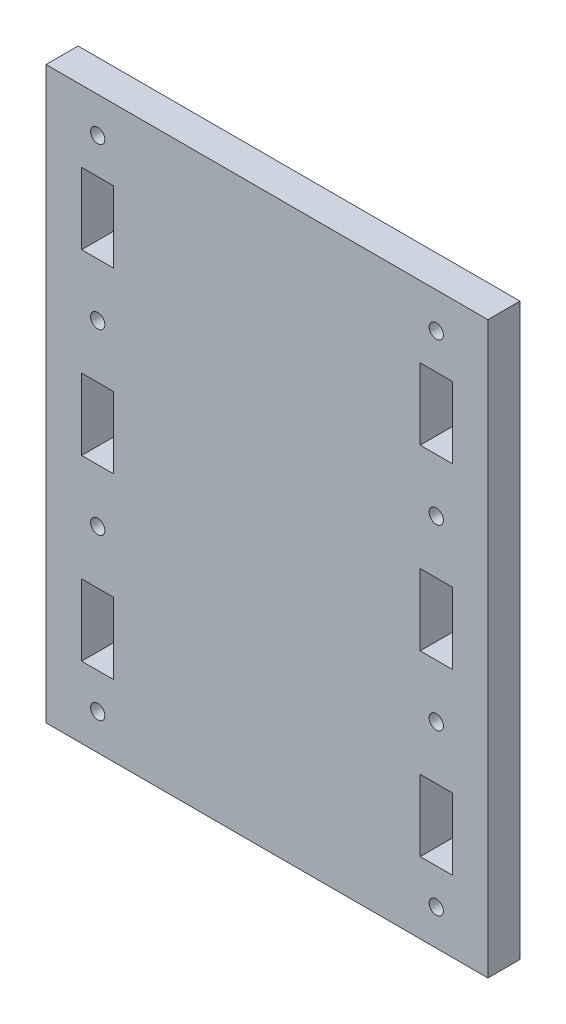
ISO-10303-21;
HEADER;
FILE_DESCRIPTION(('STEP AP214'),'2;1');
FILE_NAME('part.step','',(''),(''),'','','');
FILE_SCHEMA(('AUTOMOTIVE_DESIGN { 1 0 10303 214 1 1 1 1 }'));
ENDSEC;
DATA;
#1=APPLICATION_CONTEXT('core data for automotive mechanical design processes');
#2=APPLICATION_PROTOCOL_DEFINITION('international standard','automotive_design',2000,#1);
#3=PRODUCT_CONTEXT('',#1,'mechanical');
#4=PRODUCT('Part','Part','',(#3));
#5=PRODUCT_RELATED_PRODUCT_CATEGORY('part','',(#4));
#6=PRODUCT_DEFINITION_FORMATION('','',#4);
#7=PRODUCT_DEFINITION_CONTEXT('part definition',#1,'design');
#8=PRODUCT_DEFINITION('design','',#6,#7);
#9=PRODUCT_DEFINITION_SHAPE('','',#8);
#10=(LENGTH_UNIT() NAMED_UNIT(*) SI_UNIT(.MILLI.,.METRE.));
#11=(NAMED_UNIT(*) PLANE_ANGLE_UNIT() SI_UNIT($,.RADIAN.));
#12=(NAMED_UNIT(*) SI_UNIT($,.STERADIAN.) SOLID_ANGLE_UNIT());
#13=UNCERTAINTY_MEASURE_WITH_UNIT(LENGTH_MEASURE(1.E-05),#10,'distance_accuracy_value','');
#14=(GEOMETRIC_REPRESENTATION_CONTEXT(3) GLOBAL_UNCERTAINTY_ASSIGNED_CONTEXT((#13)) GLOBAL_UNIT_ASSIGNED_CONTEXT((#10,
#11,#12)) REPRESENTATION_CONTEXT('',''));
#15=CARTESIAN_POINT('',(0.,0.,0.));
#16=DIRECTION('',(0.,0.,1.));
#17=DIRECTION('',(1.,0.,0.));
#18=AXIS2_PLACEMENT_3D('',#15,#16,#17);
#19=CARTESIAN_POINT('',(0.,0.,29.));
#20=DIRECTION('',(0.,0.,1.));
#21=DIRECTION('',(1.,0.,0.));
#22=AXIS2_PLACEMENT_3D('',#19,#20,#21);
#23=PLANE('',#22);
#24=CARTESIAN_POINT('',(47.5,200.,29.));
#25=DIRECTION('',(0.,0.,-1.));
#26=DIRECTION('',(-1.,0.,0.));
#27=AXIS2_PLACEMENT_3D('',#24,#25,#26);
#28=CIRCLE('',#27,2.);
#29=CARTESIAN_POINT('',(45.5,200.,29.));
#30=VERTEX_POINT('',#29);
#31=EDGE_CURVE('E885',#30,#30,#28,.T.);
#32=ORIENTED_EDGE('',*,*,#31,.T.);
#33=EDGE_LOOP('',(#32));
#34=FACE_BOUND('',#33,.T.);
#35=CARTESIAN_POINT('',(-47.5,60.,29.));
#36=DIRECTION('',(0.,0.,-1.));
#37=DIRECTION('',(-1.,0.,0.));
#38=AXIS2_PLACEMENT_3D('',#35,#36,#37);
#39=CIRCLE('',#38,2.);
#40=CARTESIAN_POINT('',(-49.5,60.,29.));
#41=VERTEX_POINT('',#40);
#42=EDGE_CURVE('E893',#41,#41,#39,.T.);
#43=ORIENTED_EDGE('',*,*,#42,.T.);
#44=EDGE_LOOP('',(#43));
#45=FACE_BOUND('',#44,.T.);
#46=CARTESIAN_POINT('',(-47.5,105.,29.));
#47=DIRECTION('',(0.,0.,-1.));
#48=DIRECTION('',(-1.,0.,0.));
#49=AXIS2_PLACEMENT_3D('',#46,#47,#48);
#50=CIRCLE('',#49,2.);
#51=CARTESIAN_POINT('',(-49.5,105.,29.));
#52=VERTEX_POINT('',#51);
#53=EDGE_CURVE('E899',#52,#52,#50,.T.);
#54=ORIENTED_EDGE('',*,*,#53,.T.);
#55=EDGE_LOOP('',(#54));
#56=FACE_BOUND('',#55,.T.);
#57=CARTESIAN_POINT('',(-47.5,155.,29.));
#58=DIRECTION('',(0.,0.,-1.));
#59=DIRECTION('',(-1.,0.,0.));
#60=AXIS2_PLACEMENT_3D('',#57,#58,#59);
#61=CIRCLE('',#60,2.);
#62=CARTESIAN_POINT('',(-49.5,155.,29.));
#63=VERTEX_POINT('',#62);
#64=EDGE_CURVE('E905',#63,#63,#61,.T.);
#65=ORIENTED_EDGE('',*,*,#64,.T.);
#66=EDGE_LOOP('',(#65));
#67=FACE_BOUND('',#66,.T.);
#68=CARTESIAN_POINT('',(-47.5,200.,29.));
#69=DIRECTION('',(0.,0.,-1.));
#70=DIRECTION('',(-1.,0.,0.));
#71=AXIS2_PLACEMENT_3D('',#68,#69,#70);
#72=CIRCLE('',#71,2.);
#73=CARTESIAN_POINT('',(-49.5,200.,29.));
#74=VERTEX_POINT('',#73);
#75=EDGE_CURVE('E911',#74,#74,#72,.T.);
#76=ORIENTED_EDGE('',*,*,#75,.T.);
#77=EDGE_LOOP('',(#76));
#78=FACE_BOUND('',#77,.T.);
#79=CARTESIAN_POINT('',(47.5,60.,29.));
#80=DIRECTION('',(0.,0.,-1.));
#81=DIRECTION('',(-1.,0.,0.));
#82=AXIS2_PLACEMENT_3D('',#79,#80,#81);
#83=CIRCLE('',#82,2.);
#84=CARTESIAN_POINT('',(45.5,60.,29.));
#85=VERTEX_POINT('',#84);
#86=EDGE_CURVE('E917',#85,#85,#83,.T.);
#87=ORIENTED_EDGE('',*,*,#86,.T.);
#88=EDGE_LOOP('',(#87));
#89=FACE_BOUND('',#88,.T.);
#90=CARTESIAN_POINT('',(47.5,105.,29.));
#91=DIRECTION('',(0.,0.,-1.));
#92=DIRECTION('',(-1.,0.,0.));
#93=AXIS2_PLACEMENT_3D('',#90,#91,#92);
#94=CIRCLE('',#93,2.);
#95=CARTESIAN_POINT('',(45.5,105.,29.));
#96=VERTEX_POINT('',#95);
#97=EDGE_CURVE('E923',#96,#96,#94,.T.);
#98=ORIENTED_EDGE('',*,*,#97,.T.);
#99=EDGE_LOOP('',(#98));
#100=FACE_BOUND('',#99,.T.);
#101=CARTESIAN_POINT('',(47.5,155.,29.));
#102=DIRECTION('',(0.,0.,-1.));
#103=DIRECTION('',(-1.,0.,0.));
#104=AXIS2_PLACEMENT_3D('',#101,#102,#103);
#105=CIRCLE('',#104,2.);
#106=CARTESIAN_POINT('',(45.5,155.,29.));
#107=VERTEX_POINT('',#106);
#108=EDGE_CURVE('E244',#107,#107,#105,.T.);
#109=ORIENTED_EDGE('',*,*,#108,.T.);
#110=EDGE_LOOP('',(#109));
#111=FACE_BOUND('',#110,.T.);
#112=DIRECTION('',(0.,-1.,0.));
#113=VECTOR('',#112,1.);
#114=CARTESIAN_POINT('',(-62.,0.,29.));
#115=LINE('',#114,#113);
#116=CARTESIAN_POINT('',(-62.,210.,29.));
#117=VERTEX_POINT('',#116);
#118=CARTESIAN_POINT('',(-62.,50.,29.));
#119=VERTEX_POINT('',#118);
#120=EDGE_CURVE('E413',#117,#119,#115,.T.);
#121=ORIENTED_EDGE('',*,*,#120,.T.);
#122=DIRECTION('',(1.,0.,0.));
#123=VECTOR('',#122,1.);
#124=CARTESIAN_POINT('',(0.,50.,29.));
#125=LINE('',#124,#123);
#126=CARTESIAN_POINT('',(62.,50.,29.));
#127=VERTEX_POINT('',#126);
#128=EDGE_CURVE('E416',#119,#127,#125,.T.);
#129=ORIENTED_EDGE('',*,*,#128,.T.);
#130=DIRECTION('',(0.,-1.,0.));
#131=VECTOR('',#130,1.);
#132=CARTESIAN_POINT('',(62.,0.,29.));
#133=LINE('',#132,#131);
#134=CARTESIAN_POINT('',(62.,210.,29.));
#135=VERTEX_POINT('',#134);
#136=EDGE_CURVE('E419',#135,#127,#133,.T.);
#137=ORIENTED_EDGE('',*,*,#136,.F.);
#138=DIRECTION('',(1.,0.,0.));
#139=VECTOR('',#138,1.);
#140=CARTESIAN_POINT('',(0.,210.,29.));
#141=LINE('',#140,#139);
#142=EDGE_CURVE('E422',#117,#135,#141,.T.);
#143=ORIENTED_EDGE('',*,*,#142,.F.);
#144=EDGE_LOOP('',(#121,#129,#137,#143));
#145=FACE_BOUND('',#144,.T.);
#146=DIRECTION('',(0.,-1.,0.));
#147=VECTOR('',#146,1.);
#148=CARTESIAN_POINT('',(-52.,0.,29.));
#149=LINE('',#148,#147);
#150=CARTESIAN_POINT('',(-52.,190.,29.));
#151=VERTEX_POINT('',#150);
#152=CARTESIAN_POINT('',(-52.,170.,29.));
#153=VERTEX_POINT('',#152);
#154=EDGE_CURVE('E383',#151,#153,#149,.T.);
#155=ORIENTED_EDGE('',*,*,#154,.F.);
#156=DIRECTION('',(-1.,0.,0.));
#157=VECTOR('',#156,1.);
#158=CARTESIAN_POINT('',(0.,190.,29.));
#159=LINE('',#158,#157);
#160=CARTESIAN_POINT('',(-43.,190.,29.));
#161=VERTEX_POINT('',#160);
#162=EDGE_CURVE('E381',#161,#151,#159,.T.);
#163=ORIENTED_EDGE('',*,*,#162,.F.);
#164=DIRECTION('',(0.,-1.,0.));
#165=VECTOR('',#164,1.);
#166=CARTESIAN_POINT('',(-43.,0.,29.));
#167=LINE('',#166,#165);
#168=CARTESIAN_POINT('',(-43.,170.,29.));
#169=VERTEX_POINT('',#168);
#170=EDGE_CURVE('E389',#161,#169,#167,.T.);
#171=ORIENTED_EDGE('',*,*,#170,.T.);
#172=DIRECTION('',(1.,0.,0.));
#173=VECTOR('',#172,1.);
#174=CARTESIAN_POINT('',(0.,170.,29.));
#175=LINE('',#174,#173);
#176=EDGE_CURVE('E386',#153,#169,#175,.T.);
#177=ORIENTED_EDGE('',*,*,#176,.F.);
#178=EDGE_LOOP('',(#155,#163,#171,#177));
#179=FACE_BOUND('',#178,.T.);
#180=DIRECTION('',(0.,-1.,0.));
#181=VECTOR('',#180,1.);
#182=CARTESIAN_POINT('',(-43.,0.,29.));
#183=LINE('',#182,#181);
#184=CARTESIAN_POINT('',(-43.,140.,29.));
#185=VERTEX_POINT('',#184);
#186=CARTESIAN_POINT('',(-43.,120.,29.));
#187=VERTEX_POINT('',#186);
#188=EDGE_CURVE('E352',#185,#187,#183,.T.);
#189=ORIENTED_EDGE('',*,*,#188,.T.);
#190=DIRECTION('',(1.,0.,0.));
#191=VECTOR('',#190,1.);
#192=CARTESIAN_POINT('',(0.,120.,29.));
#193=LINE('',#192,#191);
#194=CARTESIAN_POINT('',(-52.,120.,29.));
#195=VERTEX_POINT('',#194);
#196=EDGE_CURVE('E350',#195,#187,#193,.T.);
#197=ORIENTED_EDGE('',*,*,#196,.F.);
#198=DIRECTION('',(0.,-1.,0.));
#199=VECTOR('',#198,1.);
#200=CARTESIAN_POINT('',(-52.,0.,29.));
#201=LINE('',#200,#199);
#202=CARTESIAN_POINT('',(-52.,140.,29.));
#203=VERTEX_POINT('',#202);
#204=EDGE_CURVE('E359',#203,#195,#201,.T.);
#205=ORIENTED_EDGE('',*,*,#204,.F.);
#206=DIRECTION('',(-1.,0.,0.));
#207=VECTOR('',#206,1.);
#208=CARTESIAN_POINT('',(0.,140.,29.));
#209=LINE('',#208,#207);
#210=EDGE_CURVE('E356',#185,#203,#209,.T.);
#211=ORIENTED_EDGE('',*,*,#210,.F.);
#212=EDGE_LOOP('',(#189,#197,#205,#211));
#213=FACE_BOUND('',#212,.T.);
#214=DIRECTION('',(0.,-1.,0.));
#215=VECTOR('',#214,1.);
#216=CARTESIAN_POINT('',(-43.,0.,29.));
#217=LINE('',#216,#215);
#218=CARTESIAN_POINT('',(-43.,90.,29.));
#219=VERTEX_POINT('',#218);
#220=CARTESIAN_POINT('',(-43.,70.,29.));
#221=VERTEX_POINT('',#220);
#222=EDGE_CURVE('E321',#219,#221,#217,.T.);
#223=ORIENTED_EDGE('',*,*,#222,.T.);
#224=DIRECTION('',(1.,0.,0.));
#225=VECTOR('',#224,1.);
#226=CARTESIAN_POINT('',(0.,70.,29.));
#227=LINE('',#226,#225);
#228=CARTESIAN_POINT('',(-52.,70.,29.));
#229=VERTEX_POINT('',#228);
#230=EDGE_CURVE('E319',#229,#221,#227,.T.);
#231=ORIENTED_EDGE('',*,*,#230,.F.);
#232=DIRECTION('',(0.,-1.,0.));
#233=VECTOR('',#232,1.);
#234=CARTESIAN_POINT('',(-52.,0.,29.));
#235=LINE('',#234,#233);
#236=CARTESIAN_POINT('',(-52.,90.,29.));
#237=VERTEX_POINT('',#236);
#238=EDGE_CURVE('E328',#237,#229,#235,.T.);
#239=ORIENTED_EDGE('',*,*,#238,.F.);
#240=DIRECTION('',(-1.,0.,0.));
#241=VECTOR('',#240,1.);
#242=CARTESIAN_POINT('',(0.,90.,29.));
#243=LINE('',#242,#241);
#244=EDGE_CURVE('E325',#219,#237,#243,.T.);
#245=ORIENTED_EDGE('',*,*,#244,.F.);
#246=EDGE_LOOP('',(#223,#231,#239,#245));
#247=FACE_BOUND('',#246,.T.);
#248=DIRECTION('',(-1.,0.,0.));
#249=VECTOR('',#248,1.);
#250=CARTESIAN_POINT('',(0.,170.,29.));
#251=LINE('',#250,#249);
#252=CARTESIAN_POINT('',(52.,170.,29.));
#253=VERTEX_POINT('',#252);
#254=CARTESIAN_POINT('',(43.,170.,29.));
#255=VERTEX_POINT('',#254);
#256=EDGE_CURVE('E289',#253,#255,#251,.T.);
#257=ORIENTED_EDGE('',*,*,#256,.T.);
#258=DIRECTION('',(0.,-1.,0.));
#259=VECTOR('',#258,1.);
#260=CARTESIAN_POINT('',(43.,0.,29.));
#261=LINE('',#260,#259);
#262=CARTESIAN_POINT('',(43.,190.,29.));
#263=VERTEX_POINT('',#262);
#264=EDGE_CURVE('E287',#263,#255,#261,.T.);
#265=ORIENTED_EDGE('',*,*,#264,.F.);
#266=DIRECTION('',(1.,0.,0.));
#267=VECTOR('',#266,1.);
#268=CARTESIAN_POINT('',(0.,190.,29.));
#269=LINE('',#268,#267);
#270=CARTESIAN_POINT('',(52.,190.,29.));
#271=VERTEX_POINT('',#270);
#272=EDGE_CURVE('E296',#263,#271,#269,.T.);
#273=ORIENTED_EDGE('',*,*,#272,.T.);
#274=DIRECTION('',(0.,-1.,0.));
#275=VECTOR('',#274,1.);
#276=CARTESIAN_POINT('',(52.,0.,29.));
#277=LINE('',#276,#275);
#278=EDGE_CURVE('E293',#271,#253,#277,.T.);
#279=ORIENTED_EDGE('',*,*,#278,.T.);
#280=EDGE_LOOP('',(#257,#265,#273,#279));
#281=FACE_BOUND('',#280,.T.);
#282=DIRECTION('',(-1.,0.,0.));
#283=VECTOR('',#282,1.);
#284=CARTESIAN_POINT('',(0.,120.,29.));
#285=LINE('',#284,#283);
#286=CARTESIAN_POINT('',(52.,120.,29.));
#287=VERTEX_POINT('',#286);
#288=CARTESIAN_POINT('',(43.,120.,29.));
#289=VERTEX_POINT('',#288);
#290=EDGE_CURVE('E257',#287,#289,#285,.T.);
#291=ORIENTED_EDGE('',*,*,#290,.T.);
#292=DIRECTION('',(0.,-1.,0.));
#293=VECTOR('',#292,1.);
#294=CARTESIAN_POINT('',(43.,0.,29.));
#295=LINE('',#294,#293);
#296=CARTESIAN_POINT('',(43.,140.,29.));
#297=VERTEX_POINT('',#296);
#298=EDGE_CURVE('E255',#297,#289,#295,.T.);
#299=ORIENTED_EDGE('',*,*,#298,.F.);
#300=DIRECTION('',(1.,0.,0.));
#301=VECTOR('',#300,1.);
#302=CARTESIAN_POINT('',(0.,140.,29.));
#303=LINE('',#302,#301);
#304=CARTESIAN_POINT('',(52.,140.,29.));
#305=VERTEX_POINT('',#304);
#306=EDGE_CURVE('E264',#297,#305,#303,.T.);
#307=ORIENTED_EDGE('',*,*,#306,.T.);
#308=DIRECTION('',(0.,-1.,0.));
#309=VECTOR('',#308,1.);
#310=CARTESIAN_POINT('',(52.,0.,29.));
#311=LINE('',#310,#309);
#312=EDGE_CURVE('E261',#305,#287,#311,.T.);
#313=ORIENTED_EDGE('',*,*,#312,.T.);
#314=EDGE_LOOP('',(#291,#299,#307,#313));
#315=FACE_BOUND('',#314,.T.);
#316=DIRECTION('',(-1.,0.,0.));
#317=VECTOR('',#316,1.);
#318=CARTESIAN_POINT('',(0.,70.,29.));
#319=LINE('',#318,#317);
#320=CARTESIAN_POINT('',(52.,70.,29.));
#321=VERTEX_POINT('',#320);
#322=CARTESIAN_POINT('',(43.,70.,29.));
#323=VERTEX_POINT('',#322);
#324=EDGE_CURVE('E226',#321,#323,#319,.T.);
#325=ORIENTED_EDGE('',*,*,#324,.T.);
#326=DIRECTION('',(0.,-1.,0.));
#327=VECTOR('',#326,1.);
#328=CARTESIAN_POINT('',(43.,0.,29.));
#329=LINE('',#328,#327);
#330=CARTESIAN_POINT('',(43.,90.,29.));
#331=VERTEX_POINT('',#330);
#332=EDGE_CURVE('E216',#331,#323,#329,.T.);
#333=ORIENTED_EDGE('',*,*,#332,.F.);
#334=DIRECTION('',(1.,0.,0.));
#335=VECTOR('',#334,1.);
#336=CARTESIAN_POINT('',(0.,90.,29.));
#337=LINE('',#336,#335);
#338=CARTESIAN_POINT('',(52.,90.,29.));
#339=VERTEX_POINT('',#338);
#340=EDGE_CURVE('E238',#331,#339,#337,.T.);
#341=ORIENTED_EDGE('',*,*,#340,.T.);
#342=DIRECTION('',(0.,-1.,0.));
#343=VECTOR('',#342,1.);
#344=CARTESIAN_POINT('',(52.,0.,29.));
#345=LINE('',#344,#343);
#346=EDGE_CURVE('E48',#339,#321,#345,.T.);
#347=ORIENTED_EDGE('',*,*,#346,.T.);
#348=EDGE_LOOP('',(#325,#333,#341,#347));
#349=FACE_BOUND('',#348,.T.);
#350=ADVANCED_FACE('F33',(#34,#45,#56,#67,#78,#89,#100,#111,#145,#179,#213,#247,#281,#315,#349),
#23,.T.);
#351=CARTESIAN_POINT('',(0.,0.,20.));
#352=DIRECTION('',(0.,0.,1.));
#353=DIRECTION('',(1.,0.,0.));
#354=AXIS2_PLACEMENT_3D('',#351,#352,#353);
#355=PLANE('',#354);
#356=CARTESIAN_POINT('',(47.5,200.,20.));
#357=DIRECTION('',(0.,0.,-1.));
#358=DIRECTION('',(-1.,0.,0.));
#359=AXIS2_PLACEMENT_3D('',#356,#357,#358);
#360=CIRCLE('',#359,2.);
#361=CARTESIAN_POINT('',(45.5,200.,20.));
#362=VERTEX_POINT('',#361);
#363=EDGE_CURVE('E888',#362,#362,#360,.T.);
#364=ORIENTED_EDGE('',*,*,#363,.F.);
#365=EDGE_LOOP('',(#364));
#366=FACE_BOUND('',#365,.T.);
#367=CARTESIAN_POINT('',(-47.5,60.,20.));
#368=DIRECTION('',(0.,0.,-1.));
#369=DIRECTION('',(-1.,0.,0.));
#370=AXIS2_PLACEMENT_3D('',#367,#368,#369);
#371=CIRCLE('',#370,2.);
#372=CARTESIAN_POINT('',(-49.5,60.,20.));
#373=VERTEX_POINT('',#372);
#374=EDGE_CURVE('E890',#373,#373,#371,.T.);
#375=ORIENTED_EDGE('',*,*,#374,.F.);
#376=EDGE_LOOP('',(#375));
#377=FACE_BOUND('',#376,.T.);
#378=CARTESIAN_POINT('',(-47.5,105.,20.));
#379=DIRECTION('',(0.,0.,-1.));
#380=DIRECTION('',(-1.,0.,0.));
#381=AXIS2_PLACEMENT_3D('',#378,#379,#380);
#382=CIRCLE('',#381,2.);
#383=CARTESIAN_POINT('',(-49.5,105.,20.));
#384=VERTEX_POINT('',#383);
#385=EDGE_CURVE('E896',#384,#384,#382,.T.);
#386=ORIENTED_EDGE('',*,*,#385,.F.);
#387=EDGE_LOOP('',(#386));
#388=FACE_BOUND('',#387,.T.);
#389=CARTESIAN_POINT('',(-47.5,155.,20.));
#390=DIRECTION('',(0.,0.,-1.));
#391=DIRECTION('',(-1.,0.,0.));
#392=AXIS2_PLACEMENT_3D('',#389,#390,#391);
#393=CIRCLE('',#392,2.);
#394=CARTESIAN_POINT('',(-49.5,155.,20.));
#395=VERTEX_POINT('',#394);
#396=EDGE_CURVE('E902',#395,#395,#393,.T.);
#397=ORIENTED_EDGE('',*,*,#396,.F.);
#398=EDGE_LOOP('',(#397));
#399=FACE_BOUND('',#398,.T.);
#400=CARTESIAN_POINT('',(-47.5,200.,20.));
#401=DIRECTION('',(0.,0.,-1.));
#402=DIRECTION('',(-1.,0.,0.));
#403=AXIS2_PLACEMENT_3D('',#400,#401,#402);
#404=CIRCLE('',#403,2.);
#405=CARTESIAN_POINT('',(-49.5,200.,20.));
#406=VERTEX_POINT('',#405);
#407=EDGE_CURVE('E908',#406,#406,#404,.T.);
#408=ORIENTED_EDGE('',*,*,#407,.F.);
#409=EDGE_LOOP('',(#408));
#410=FACE_BOUND('',#409,.T.);
#411=CARTESIAN_POINT('',(47.5,60.,20.));
#412=DIRECTION('',(0.,0.,-1.));
#413=DIRECTION('',(-1.,0.,0.));
#414=AXIS2_PLACEMENT_3D('',#411,#412,#413);
#415=CIRCLE('',#414,2.);
#416=CARTESIAN_POINT('',(45.5,60.,20.));
#417=VERTEX_POINT('',#416);
#418=EDGE_CURVE('E914',#417,#417,#415,.T.);
#419=ORIENTED_EDGE('',*,*,#418,.F.);
#420=EDGE_LOOP('',(#419));
#421=FACE_BOUND('',#420,.T.);
#422=CARTESIAN_POINT('',(47.5,105.,20.));
#423=DIRECTION('',(0.,0.,-1.));
#424=DIRECTION('',(-1.,0.,0.));
#425=AXIS2_PLACEMENT_3D('',#422,#423,#424);
#426=CIRCLE('',#425,2.);
#427=CARTESIAN_POINT('',(45.5,105.,20.));
#428=VERTEX_POINT('',#427);
#429=EDGE_CURVE('E920',#428,#428,#426,.T.);
#430=ORIENTED_EDGE('',*,*,#429,.F.);
#431=EDGE_LOOP('',(#430));
#432=FACE_BOUND('',#431,.T.);
#433=CARTESIAN_POINT('',(47.5,155.,20.));
#434=DIRECTION('',(0.,0.,-1.));
#435=DIRECTION('',(-1.,0.,0.));
#436=AXIS2_PLACEMENT_3D('',#433,#434,#435);
#437=CIRCLE('',#436,2.);
#438=CARTESIAN_POINT('',(45.5,155.,20.));
#439=VERTEX_POINT('',#438);
#440=EDGE_CURVE('E926',#439,#439,#437,.T.);
#441=ORIENTED_EDGE('',*,*,#440,.F.);
#442=EDGE_LOOP('',(#441));
#443=FACE_BOUND('',#442,.T.);
#444=DIRECTION('',(0.,-1.,0.));
#445=VECTOR('',#444,1.);
#446=CARTESIAN_POINT('',(43.,0.,20.));
#447=LINE('',#446,#445);
#448=CARTESIAN_POINT('',(43.,140.,20.));
#449=VERTEX_POINT('',#448);
#450=CARTESIAN_POINT('',(43.,120.,20.));
#451=VERTEX_POINT('',#450);
#452=EDGE_CURVE('E234',#449,#451,#447,.T.);
#453=ORIENTED_EDGE('',*,*,#452,.T.);
#454=DIRECTION('',(-1.,0.,0.));
#455=VECTOR('',#454,1.);
#456=CARTESIAN_POINT('',(0.,120.,20.));
#457=LINE('',#456,#455);
#458=CARTESIAN_POINT('',(52.,120.,20.));
#459=VERTEX_POINT('',#458);
#460=EDGE_CURVE('E270',#459,#451,#457,.T.);
#461=ORIENTED_EDGE('',*,*,#460,.F.);
#462=DIRECTION('',(0.,-1.,0.));
#463=VECTOR('',#462,1.);
#464=CARTESIAN_POINT('',(52.,0.,20.));
#465=LINE('',#464,#463);
#466=CARTESIAN_POINT('',(52.,140.,20.));
#467=VERTEX_POINT('',#466);
#468=EDGE_CURVE('E273',#467,#459,#465,.T.);
#469=ORIENTED_EDGE('',*,*,#468,.F.);
#470=DIRECTION('',(1.,0.,0.));
#471=VECTOR('',#470,1.);
#472=CARTESIAN_POINT('',(0.,140.,20.));
#473=LINE('',#472,#471);
#474=EDGE_CURVE('E258',#449,#467,#473,.T.);
#475=ORIENTED_EDGE('',*,*,#474,.F.);
#476=EDGE_LOOP('',(#453,#461,#469,#475));
#477=FACE_BOUND('',#476,.T.);
#478=DIRECTION('',(1.,0.,0.));
#479=VECTOR('',#478,1.);
#480=CARTESIAN_POINT('',(0.,70.,20.));
#481=LINE('',#480,#479);
#482=CARTESIAN_POINT('',(-52.,70.,20.));
#483=VERTEX_POINT('',#482);
#484=CARTESIAN_POINT('',(-43.,70.,20.));
#485=VERTEX_POINT('',#484);
#486=EDGE_CURVE('E318',#483,#485,#481,.T.);
#487=ORIENTED_EDGE('',*,*,#486,.T.);
#488=DIRECTION('',(0.,-1.,0.));
#489=VECTOR('',#488,1.);
#490=CARTESIAN_POINT('',(-43.,0.,20.));
#491=LINE('',#490,#489);
#492=CARTESIAN_POINT('',(-43.,90.,20.));
#493=VERTEX_POINT('',#492);
#494=EDGE_CURVE('E333',#493,#485,#491,.T.);
#495=ORIENTED_EDGE('',*,*,#494,.F.);
#496=DIRECTION('',(-1.,0.,0.));
#497=VECTOR('',#496,1.);
#498=CARTESIAN_POINT('',(0.,90.,20.));
#499=LINE('',#498,#497);
#500=CARTESIAN_POINT('',(-52.,90.,20.));
#501=VERTEX_POINT('',#500);
#502=EDGE_CURVE('E336',#493,#501,#499,.T.);
#503=ORIENTED_EDGE('',*,*,#502,.T.);
#504=DIRECTION('',(0.,-1.,0.));
#505=VECTOR('',#504,1.);
#506=CARTESIAN_POINT('',(-52.,0.,20.));
#507=LINE('',#506,#505);
#508=EDGE_CURVE('E322',#501,#483,#507,.T.);
#509=ORIENTED_EDGE('',*,*,#508,.T.);
#510=EDGE_LOOP('',(#487,#495,#503,#509));
#511=FACE_BOUND('',#510,.T.);
#512=DIRECTION('',(-1.,0.,0.));
#513=VECTOR('',#512,1.);
#514=CARTESIAN_POINT('',(0.,190.,20.));
#515=LINE('',#514,#513);
#516=CARTESIAN_POINT('',(-43.,190.,20.));
#517=VERTEX_POINT('',#516);
#518=CARTESIAN_POINT('',(-52.,190.,20.));
#519=VERTEX_POINT('',#518);
#520=EDGE_CURVE('E380',#517,#519,#515,.T.);
#521=ORIENTED_EDGE('',*,*,#520,.T.);
#522=DIRECTION('',(0.,-1.,0.));
#523=VECTOR('',#522,1.);
#524=CARTESIAN_POINT('',(-52.,0.,20.));
#525=LINE('',#524,#523);
#526=CARTESIAN_POINT('',(-52.,170.,20.));
#527=VERTEX_POINT('',#526);
#528=EDGE_CURVE('E395',#519,#527,#525,.T.);
#529=ORIENTED_EDGE('',*,*,#528,.T.);
#530=DIRECTION('',(1.,0.,0.));
#531=VECTOR('',#530,1.);
#532=CARTESIAN_POINT('',(0.,170.,20.));
#533=LINE('',#532,#531);
#534=CARTESIAN_POINT('',(-43.,170.,20.));
#535=VERTEX_POINT('',#534);
#536=EDGE_CURVE('E398',#527,#535,#533,.T.);
#537=ORIENTED_EDGE('',*,*,#536,.T.);
#538=DIRECTION('',(0.,-1.,0.));
#539=VECTOR('',#538,1.);
#540=CARTESIAN_POINT('',(-43.,0.,20.));
#541=LINE('',#540,#539);
#542=EDGE_CURVE('E384',#517,#535,#541,.T.);
#543=ORIENTED_EDGE('',*,*,#542,.F.);
#544=EDGE_LOOP('',(#521,#529,#537,#543));
#545=FACE_BOUND('',#544,.T.);
#546=DIRECTION('',(0.,-1.,0.));
#547=VECTOR('',#546,1.);
#548=CARTESIAN_POINT('',(-62.,0.,20.));
#549=LINE('',#548,#547);
#550=CARTESIAN_POINT('',(-62.,210.,20.));
#551=VERTEX_POINT('',#550);
#552=CARTESIAN_POINT('',(-62.,50.,20.));
#553=VERTEX_POINT('',#552);
#554=EDGE_CURVE('E412',#551,#553,#549,.T.);
#555=ORIENTED_EDGE('',*,*,#554,.F.);
#556=DIRECTION('',(1.,0.,0.));
#557=VECTOR('',#556,1.);
#558=CARTESIAN_POINT('',(0.,210.,20.));
#559=LINE('',#558,#557);
#560=CARTESIAN_POINT('',(62.,210.,20.));
#561=VERTEX_POINT('',#560);
#562=EDGE_CURVE('E417',#551,#561,#559,.T.);
#563=ORIENTED_EDGE('',*,*,#562,.T.);
#564=DIRECTION('',(0.,-1.,0.));
#565=VECTOR('',#564,1.);
#566=CARTESIAN_POINT('',(62.,0.,20.));
#567=LINE('',#566,#565);
#568=CARTESIAN_POINT('',(62.,50.,20.));
#569=VERTEX_POINT('',#568);
#570=EDGE_CURVE('E431',#561,#569,#567,.T.);
#571=ORIENTED_EDGE('',*,*,#570,.T.);
#572=DIRECTION('',(1.,0.,0.));
#573=VECTOR('',#572,1.);
#574=CARTESIAN_POINT('',(0.,50.,20.));
#575=LINE('',#574,#573);
#576=EDGE_CURVE('E428',#553,#569,#575,.T.);
#577=ORIENTED_EDGE('',*,*,#576,.F.);
#578=EDGE_LOOP('',(#555,#563,#571,#577));
#579=FACE_BOUND('',#578,.T.);
#580=DIRECTION('',(1.,0.,0.));
#581=VECTOR('',#580,1.);
#582=CARTESIAN_POINT('',(0.,120.,20.));
#583=LINE('',#582,#581);
#584=CARTESIAN_POINT('',(-52.,120.,20.));
#585=VERTEX_POINT('',#584);
#586=CARTESIAN_POINT('',(-43.,120.,20.));
#587=VERTEX_POINT('',#586);
#588=EDGE_CURVE('E349',#585,#587,#583,.T.);
#589=ORIENTED_EDGE('',*,*,#588,.T.);
#590=DIRECTION('',(0.,-1.,0.));
#591=VECTOR('',#590,1.);
#592=CARTESIAN_POINT('',(-43.,0.,20.));
#593=LINE('',#592,#591);
#594=CARTESIAN_POINT('',(-43.,140.,20.));
#595=VERTEX_POINT('',#594);
#596=EDGE_CURVE('E364',#595,#587,#593,.T.);
#597=ORIENTED_EDGE('',*,*,#596,.F.);
#598=DIRECTION('',(-1.,0.,0.));
#599=VECTOR('',#598,1.);
#600=CARTESIAN_POINT('',(0.,140.,20.));
#601=LINE('',#600,#599);
#602=CARTESIAN_POINT('',(-52.,140.,20.));
#603=VERTEX_POINT('',#602);
#604=EDGE_CURVE('E367',#595,#603,#601,.T.);
#605=ORIENTED_EDGE('',*,*,#604,.T.);
#606=DIRECTION('',(0.,-1.,0.));
#607=VECTOR('',#606,1.);
#608=CARTESIAN_POINT('',(-52.,0.,20.));
#609=LINE('',#608,#607);
#610=EDGE_CURVE('E353',#603,#585,#609,.T.);
#611=ORIENTED_EDGE('',*,*,#610,.T.);
#612=EDGE_LOOP('',(#589,#597,#605,#611));
#613=FACE_BOUND('',#612,.T.);
#614=DIRECTION('',(0.,-1.,0.));
#615=VECTOR('',#614,1.);
#616=CARTESIAN_POINT('',(43.,0.,20.));
#617=LINE('',#616,#615);
#618=CARTESIAN_POINT('',(43.,190.,20.));
#619=VERTEX_POINT('',#618);
#620=CARTESIAN_POINT('',(43.,170.,20.));
#621=VERTEX_POINT('',#620);
#622=EDGE_CURVE('E286',#619,#621,#617,.T.);
#623=ORIENTED_EDGE('',*,*,#622,.T.);
#624=DIRECTION('',(-1.,0.,0.));
#625=VECTOR('',#624,1.);
#626=CARTESIAN_POINT('',(0.,170.,20.));
#627=LINE('',#626,#625);
#628=CARTESIAN_POINT('',(52.,170.,20.));
#629=VERTEX_POINT('',#628);
#630=EDGE_CURVE('E302',#629,#621,#627,.T.);
#631=ORIENTED_EDGE('',*,*,#630,.F.);
#632=DIRECTION('',(0.,-1.,0.));
#633=VECTOR('',#632,1.);
#634=CARTESIAN_POINT('',(52.,0.,20.));
#635=LINE('',#634,#633);
#636=CARTESIAN_POINT('',(52.,190.,20.));
#637=VERTEX_POINT('',#636);
#638=EDGE_CURVE('E305',#637,#629,#635,.T.);
#639=ORIENTED_EDGE('',*,*,#638,.F.);
#640=DIRECTION('',(1.,0.,0.));
#641=VECTOR('',#640,1.);
#642=CARTESIAN_POINT('',(0.,190.,20.));
#643=LINE('',#642,#641);
#644=EDGE_CURVE('E290',#619,#637,#643,.T.);
#645=ORIENTED_EDGE('',*,*,#644,.F.);
#646=EDGE_LOOP('',(#623,#631,#639,#645));
#647=FACE_BOUND('',#646,.T.);
#648=DIRECTION('',(0.,-1.,0.));
#649=VECTOR('',#648,1.);
#650=CARTESIAN_POINT('',(43.,0.,20.));
#651=LINE('',#650,#649);
#652=CARTESIAN_POINT('',(43.,90.,20.));
#653=VERTEX_POINT('',#652);
#654=CARTESIAN_POINT('',(43.,70.,20.));
#655=VERTEX_POINT('',#654);
#656=EDGE_CURVE('E56',#653,#655,#651,.T.);
#657=ORIENTED_EDGE('',*,*,#656,.T.);
#658=DIRECTION('',(-1.,0.,0.));
#659=VECTOR('',#658,1.);
#660=CARTESIAN_POINT('',(0.,70.,20.));
#661=LINE('',#660,#659);
#662=CARTESIAN_POINT('',(52.,70.,20.));
#663=VERTEX_POINT('',#662);
#664=EDGE_CURVE('E233',#663,#655,#661,.T.);
#665=ORIENTED_EDGE('',*,*,#664,.F.);
#666=DIRECTION('',(0.,-1.,0.));
#667=VECTOR('',#666,1.);
#668=CARTESIAN_POINT('',(52.,0.,20.));
#669=LINE('',#668,#667);
#670=CARTESIAN_POINT('',(52.,90.,20.));
#671=VERTEX_POINT('',#670);
#672=EDGE_CURVE('E246',#671,#663,#669,.T.);
#673=ORIENTED_EDGE('',*,*,#672,.F.);
#674=DIRECTION('',(1.,0.,0.));
#675=VECTOR('',#674,1.);
#676=CARTESIAN_POINT('',(0.,90.,20.));
#677=LINE('',#676,#675);
#678=EDGE_CURVE('E227',#653,#671,#677,.T.);
#679=ORIENTED_EDGE('',*,*,#678,.F.);
#680=EDGE_LOOP('',(#657,#665,#673,#679));
#681=FACE_BOUND('',#680,.T.);
#682=ADVANCED_FACE('F448',(#366,#377,#388,#399,#410,#421,#432,#443,#477,#511,#545,#579,#613,
#647,#681),#355,.F.);
#683=CARTESIAN_POINT('',(-62.,0.,29.));
#684=DIRECTION('',(1.,0.,0.));
#685=DIRECTION('',(0.,1.,0.));
#686=AXIS2_PLACEMENT_3D('',#683,#684,#685);
#687=PLANE('',#686);
#688=ORIENTED_EDGE('',*,*,#554,.T.);
#689=DIRECTION('',(0.,0.,-1.));
#690=VECTOR('',#689,1.);
#691=CARTESIAN_POINT('',(-62.,50.,29.));
#692=LINE('',#691,#690);
#693=EDGE_CURVE('E11',#119,#553,#692,.T.);
#694=ORIENTED_EDGE('',*,*,#693,.F.);
#695=ORIENTED_EDGE('',*,*,#120,.F.);
#696=DIRECTION('',(0.,0.,-1.));
#697=VECTOR('',#696,1.);
#698=CARTESIAN_POINT('',(-62.,210.,29.));
#699=LINE('',#698,#697);
#700=EDGE_CURVE('E425',#117,#551,#699,.T.);
#701=ORIENTED_EDGE('',*,*,#700,.T.);
#702=EDGE_LOOP('',(#688,#694,#695,#701));
#703=FACE_BOUND('',#702,.T.);
#704=ADVANCED_FACE('F35',(#703),#687,.F.);
#705=CARTESIAN_POINT('',(0.,50.,29.));
#706=DIRECTION('',(0.,1.,0.));
#707=DIRECTION('',(0.,0.,1.));
#708=AXIS2_PLACEMENT_3D('',#705,#706,#707);
#709=PLANE('',#708);
#710=ORIENTED_EDGE('',*,*,#576,.T.);
#711=DIRECTION('',(0.,0.,-1.));
#712=VECTOR('',#711,1.);
#713=CARTESIAN_POINT('',(62.,50.,29.));
#714=LINE('',#713,#712);
#715=EDGE_CURVE('E41',#127,#569,#714,.T.);
#716=ORIENTED_EDGE('',*,*,#715,.F.);
#717=ORIENTED_EDGE('',*,*,#128,.F.);
#718=ORIENTED_EDGE('',*,*,#693,.T.);
#719=EDGE_LOOP('',(#710,#716,#717,#718));
#720=FACE_BOUND('',#719,.T.);
#721=ADVANCED_FACE('F444',(#720),#709,.F.);
#722=CARTESIAN_POINT('',(62.,0.,29.));
#723=DIRECTION('',(1.,0.,0.));
#724=DIRECTION('',(0.,1.,0.));
#725=AXIS2_PLACEMENT_3D('',#722,#723,#724);
#726=PLANE('',#725);
#727=ORIENTED_EDGE('',*,*,#570,.F.);
#728=DIRECTION('',(0.,0.,-1.));
#729=VECTOR('',#728,1.);
#730=CARTESIAN_POINT('',(62.,210.,29.));
#731=LINE('',#730,#729);
#732=EDGE_CURVE('E437',#135,#561,#731,.T.);
#733=ORIENTED_EDGE('',*,*,#732,.F.);
#734=ORIENTED_EDGE('',*,*,#136,.T.);
#735=ORIENTED_EDGE('',*,*,#715,.T.);
#736=EDGE_LOOP('',(#727,#733,#734,#735));
#737=FACE_BOUND('',#736,.T.);
#738=ADVANCED_FACE('F441',(#737),#726,.T.);
#739=CARTESIAN_POINT('',(0.,210.,29.));
#740=DIRECTION('',(0.,1.,0.));
#741=DIRECTION('',(0.,0.,1.));
#742=AXIS2_PLACEMENT_3D('',#739,#740,#741);
#743=PLANE('',#742);
#744=ORIENTED_EDGE('',*,*,#562,.F.);
#745=ORIENTED_EDGE('',*,*,#700,.F.);
#746=ORIENTED_EDGE('',*,*,#142,.T.);
#747=ORIENTED_EDGE('',*,*,#732,.T.);
#748=EDGE_LOOP('',(#744,#745,#746,#747));
#749=FACE_BOUND('',#748,.T.);
#750=ADVANCED_FACE('F452',(#749),#743,.T.);
#751=CARTESIAN_POINT('',(0.,190.,29.));
#752=DIRECTION('',(0.,-1.,0.));
#753=DIRECTION('',(0.,0.,-1.));
#754=AXIS2_PLACEMENT_3D('',#751,#752,#753);
#755=PLANE('',#754);
#756=ORIENTED_EDGE('',*,*,#520,.F.);
#757=DIRECTION('',(0.,0.,-1.));
#758=VECTOR('',#757,1.);
#759=CARTESIAN_POINT('',(-43.,190.,29.));
#760=LINE('',#759,#758);
#761=EDGE_CURVE('E392',#161,#517,#760,.T.);
#762=ORIENTED_EDGE('',*,*,#761,.F.);
#763=ORIENTED_EDGE('',*,*,#162,.T.);
#764=DIRECTION('',(0.,0.,-1.));
#765=VECTOR('',#764,1.);
#766=CARTESIAN_POINT('',(-52.,190.,29.));
#767=LINE('',#766,#765);
#768=EDGE_CURVE('E409',#151,#519,#767,.T.);
#769=ORIENTED_EDGE('',*,*,#768,.T.);
#770=EDGE_LOOP('',(#756,#762,#763,#769));
#771=FACE_BOUND('',#770,.T.);
#772=ADVANCED_FACE('F473',(#771),#755,.T.);
#773=CARTESIAN_POINT('',(-52.,0.,29.));
#774=DIRECTION('',(1.,0.,0.));
#775=DIRECTION('',(0.,0.,-1.));
#776=AXIS2_PLACEMENT_3D('',#773,#774,#775);
#777=PLANE('',#776);
#778=ORIENTED_EDGE('',*,*,#528,.F.);
#779=ORIENTED_EDGE('',*,*,#768,.F.);
#780=ORIENTED_EDGE('',*,*,#154,.T.);
#781=DIRECTION('',(0.,0.,-1.));
#782=VECTOR('',#781,1.);
#783=CARTESIAN_POINT('',(-52.,170.,29.));
#784=LINE('',#783,#782);
#785=EDGE_CURVE('E407',#153,#527,#784,.T.);
#786=ORIENTED_EDGE('',*,*,#785,.T.);
#787=EDGE_LOOP('',(#778,#779,#780,#786));
#788=FACE_BOUND('',#787,.T.);
#789=ADVANCED_FACE('F495',(#788),#777,.T.);
#790=CARTESIAN_POINT('',(0.,170.,29.));
#791=DIRECTION('',(0.,1.,0.));
#792=DIRECTION('',(0.,0.,1.));
#793=AXIS2_PLACEMENT_3D('',#790,#791,#792);
#794=PLANE('',#793);
#795=ORIENTED_EDGE('',*,*,#536,.F.);
#796=ORIENTED_EDGE('',*,*,#785,.F.);
#797=ORIENTED_EDGE('',*,*,#176,.T.);
#798=DIRECTION('',(0.,0.,-1.));
#799=VECTOR('',#798,1.);
#800=CARTESIAN_POINT('',(-43.,170.,29.));
#801=LINE('',#800,#799);
#802=EDGE_CURVE('E405',#169,#535,#801,.T.);
#803=ORIENTED_EDGE('',*,*,#802,.T.);
#804=EDGE_LOOP('',(#795,#796,#797,#803));
#805=FACE_BOUND('',#804,.T.);
#806=ADVANCED_FACE('F503',(#805),#794,.T.);
#807=CARTESIAN_POINT('',(-43.,0.,29.));
#808=DIRECTION('',(1.,0.,0.));
#809=DIRECTION('',(0.,0.,-1.));
#810=AXIS2_PLACEMENT_3D('',#807,#808,#809);
#811=PLANE('',#810);
#812=ORIENTED_EDGE('',*,*,#542,.T.);
#813=ORIENTED_EDGE('',*,*,#802,.F.);
#814=ORIENTED_EDGE('',*,*,#170,.F.);
#815=ORIENTED_EDGE('',*,*,#761,.T.);
#816=EDGE_LOOP('',(#812,#813,#814,#815));
#817=FACE_BOUND('',#816,.T.);
#818=ADVANCED_FACE('F511',(#817),#811,.F.);
#819=CARTESIAN_POINT('',(0.,120.,29.));
#820=DIRECTION('',(0.,1.,0.));
#821=DIRECTION('',(0.,0.,1.));
#822=AXIS2_PLACEMENT_3D('',#819,#820,#821);
#823=PLANE('',#822);
#824=ORIENTED_EDGE('',*,*,#588,.F.);
#825=DIRECTION('',(0.,0.,-1.));
#826=VECTOR('',#825,1.);
#827=CARTESIAN_POINT('',(-52.,120.,29.));
#828=LINE('',#827,#826);
#829=EDGE_CURVE('E361',#195,#585,#828,.T.);
#830=ORIENTED_EDGE('',*,*,#829,.F.);
#831=ORIENTED_EDGE('',*,*,#196,.T.);
#832=DIRECTION('',(0.,0.,-1.));
#833=VECTOR('',#832,1.);
#834=CARTESIAN_POINT('',(-43.,120.,29.));
#835=LINE('',#834,#833);
#836=EDGE_CURVE('E378',#187,#587,#835,.T.);
#837=ORIENTED_EDGE('',*,*,#836,.T.);
#838=EDGE_LOOP('',(#824,#830,#831,#837));
#839=FACE_BOUND('',#838,.T.);
#840=ADVANCED_FACE('F520',(#839),#823,.T.);
#841=CARTESIAN_POINT('',(-43.,0.,29.));
#842=DIRECTION('',(1.,0.,0.));
#843=DIRECTION('',(0.,0.,-1.));
#844=AXIS2_PLACEMENT_3D('',#841,#842,#843);
#845=PLANE('',#844);
#846=ORIENTED_EDGE('',*,*,#596,.T.);
#847=ORIENTED_EDGE('',*,*,#836,.F.);
#848=ORIENTED_EDGE('',*,*,#188,.F.);
#849=DIRECTION('',(0.,0.,-1.));
#850=VECTOR('',#849,1.);
#851=CARTESIAN_POINT('',(-43.,140.,29.));
#852=LINE('',#851,#850);
#853=EDGE_CURVE('E376',#185,#595,#852,.T.);
#854=ORIENTED_EDGE('',*,*,#853,.T.);
#855=EDGE_LOOP('',(#846,#847,#848,#854));
#856=FACE_BOUND('',#855,.T.);
#857=ADVANCED_FACE('F529',(#856),#845,.F.);
#858=CARTESIAN_POINT('',(0.,140.,29.));
#859=DIRECTION('',(0.,-1.,0.));
#860=DIRECTION('',(0.,0.,-1.));
#861=AXIS2_PLACEMENT_3D('',#858,#859,#860);
#862=PLANE('',#861);
#863=ORIENTED_EDGE('',*,*,#604,.F.);
#864=ORIENTED_EDGE('',*,*,#853,.F.);
#865=ORIENTED_EDGE('',*,*,#210,.T.);
#866=DIRECTION('',(0.,0.,-1.));
#867=VECTOR('',#866,1.);
#868=CARTESIAN_POINT('',(-52.,140.,29.));
#869=LINE('',#868,#867);
#870=EDGE_CURVE('E374',#203,#603,#869,.T.);
#871=ORIENTED_EDGE('',*,*,#870,.T.);
#872=EDGE_LOOP('',(#863,#864,#865,#871));
#873=FACE_BOUND('',#872,.T.);
#874=ADVANCED_FACE('F538',(#873),#862,.T.);
#875=CARTESIAN_POINT('',(-52.,0.,29.));
#876=DIRECTION('',(1.,0.,0.));
#877=DIRECTION('',(0.,0.,-1.));
#878=AXIS2_PLACEMENT_3D('',#875,#876,#877);
#879=PLANE('',#878);
#880=ORIENTED_EDGE('',*,*,#610,.F.);
#881=ORIENTED_EDGE('',*,*,#870,.F.);
#882=ORIENTED_EDGE('',*,*,#204,.T.);
#883=ORIENTED_EDGE('',*,*,#829,.T.);
#884=EDGE_LOOP('',(#880,#881,#882,#883));
#885=FACE_BOUND('',#884,.T.);
#886=ADVANCED_FACE('F547',(#885),#879,.T.);
#887=CARTESIAN_POINT('',(0.,70.,29.));
#888=DIRECTION('',(0.,1.,0.));
#889=DIRECTION('',(0.,0.,1.));
#890=AXIS2_PLACEMENT_3D('',#887,#888,#889);
#891=PLANE('',#890);
#892=ORIENTED_EDGE('',*,*,#486,.F.);
#893=DIRECTION('',(0.,0.,-1.));
#894=VECTOR('',#893,1.);
#895=CARTESIAN_POINT('',(-52.,70.,29.));
#896=LINE('',#895,#894);
#897=EDGE_CURVE('E330',#229,#483,#896,.T.);
#898=ORIENTED_EDGE('',*,*,#897,.F.);
#899=ORIENTED_EDGE('',*,*,#230,.T.);
#900=DIRECTION('',(0.,0.,-1.));
#901=VECTOR('',#900,1.);
#902=CARTESIAN_POINT('',(-43.,70.,29.));
#903=LINE('',#902,#901);
#904=EDGE_CURVE('E347',#221,#485,#903,.T.);
#905=ORIENTED_EDGE('',*,*,#904,.T.);
#906=EDGE_LOOP('',(#892,#898,#899,#905));
#907=FACE_BOUND('',#906,.T.);
#908=ADVANCED_FACE('F556',(#907),#891,.T.);
#909=CARTESIAN_POINT('',(-43.,0.,29.));
#910=DIRECTION('',(1.,0.,0.));
#911=DIRECTION('',(0.,0.,-1.));
#912=AXIS2_PLACEMENT_3D('',#909,#910,#911);
#913=PLANE('',#912);
#914=ORIENTED_EDGE('',*,*,#494,.T.);
#915=ORIENTED_EDGE('',*,*,#904,.F.);
#916=ORIENTED_EDGE('',*,*,#222,.F.);
#917=DIRECTION('',(0.,0.,-1.));
#918=VECTOR('',#917,1.);
#919=CARTESIAN_POINT('',(-43.,90.,29.));
#920=LINE('',#919,#918);
#921=EDGE_CURVE('E345',#219,#493,#920,.T.);
#922=ORIENTED_EDGE('',*,*,#921,.T.);
#923=EDGE_LOOP('',(#914,#915,#916,#922));
#924=FACE_BOUND('',#923,.T.);
#925=ADVANCED_FACE('F565',(#924),#913,.F.);
#926=CARTESIAN_POINT('',(0.,90.,29.));
#927=DIRECTION('',(0.,-1.,0.));
#928=DIRECTION('',(0.,0.,-1.));
#929=AXIS2_PLACEMENT_3D('',#926,#927,#928);
#930=PLANE('',#929);
#931=ORIENTED_EDGE('',*,*,#502,.F.);
#932=ORIENTED_EDGE('',*,*,#921,.F.);
#933=ORIENTED_EDGE('',*,*,#244,.T.);
#934=DIRECTION('',(0.,0.,-1.));
#935=VECTOR('',#934,1.);
#936=CARTESIAN_POINT('',(-52.,90.,29.));
#937=LINE('',#936,#935);
#938=EDGE_CURVE('E343',#237,#501,#937,.T.);
#939=ORIENTED_EDGE('',*,*,#938,.T.);
#940=EDGE_LOOP('',(#931,#932,#933,#939));
#941=FACE_BOUND('',#940,.T.);
#942=ADVANCED_FACE('F574',(#941),#930,.T.);
#943=CARTESIAN_POINT('',(-52.,0.,29.));
#944=DIRECTION('',(1.,0.,0.));
#945=DIRECTION('',(0.,0.,-1.));
#946=AXIS2_PLACEMENT_3D('',#943,#944,#945);
#947=PLANE('',#946);
#948=ORIENTED_EDGE('',*,*,#508,.F.);
#949=ORIENTED_EDGE('',*,*,#938,.F.);
#950=ORIENTED_EDGE('',*,*,#238,.T.);
#951=ORIENTED_EDGE('',*,*,#897,.T.);
#952=EDGE_LOOP('',(#948,#949,#950,#951));
#953=FACE_BOUND('',#952,.T.);
#954=ADVANCED_FACE('F583',(#953),#947,.T.);
#955=CARTESIAN_POINT('',(43.,0.,29.));
#956=DIRECTION('',(1.,0.,0.));
#957=DIRECTION('',(0.,0.,-1.));
#958=AXIS2_PLACEMENT_3D('',#955,#956,#957);
#959=PLANE('',#958);
#960=ORIENTED_EDGE('',*,*,#622,.F.);
#961=DIRECTION('',(0.,0.,-1.));
#962=VECTOR('',#961,1.);
#963=CARTESIAN_POINT('',(43.,190.,29.));
#964=LINE('',#963,#962);
#965=EDGE_CURVE('E299',#263,#619,#964,.T.);
#966=ORIENTED_EDGE('',*,*,#965,.F.);
#967=ORIENTED_EDGE('',*,*,#264,.T.);
#968=DIRECTION('',(0.,0.,-1.));
#969=VECTOR('',#968,1.);
#970=CARTESIAN_POINT('',(43.,170.,29.));
#971=LINE('',#970,#969);
#972=EDGE_CURVE('E316',#255,#621,#971,.T.);
#973=ORIENTED_EDGE('',*,*,#972,.T.);
#974=EDGE_LOOP('',(#960,#966,#967,#973));
#975=FACE_BOUND('',#974,.T.);
#976=ADVANCED_FACE('F592',(#975),#959,.T.);
#977=CARTESIAN_POINT('',(0.,170.,29.));
#978=DIRECTION('',(0.,-1.,0.));
#979=DIRECTION('',(0.,0.,-1.));
#980=AXIS2_PLACEMENT_3D('',#977,#978,#979);
#981=PLANE('',#980);
#982=ORIENTED_EDGE('',*,*,#630,.T.);
#983=ORIENTED_EDGE('',*,*,#972,.F.);
#984=ORIENTED_EDGE('',*,*,#256,.F.);
#985=DIRECTION('',(0.,0.,-1.));
#986=VECTOR('',#985,1.);
#987=CARTESIAN_POINT('',(52.,170.,29.));
#988=LINE('',#987,#986);
#989=EDGE_CURVE('E314',#253,#629,#988,.T.);
#990=ORIENTED_EDGE('',*,*,#989,.T.);
#991=EDGE_LOOP('',(#982,#983,#984,#990));
#992=FACE_BOUND('',#991,.T.);
#993=ADVANCED_FACE('F601',(#992),#981,.F.);
#994=CARTESIAN_POINT('',(52.,0.,29.));
#995=DIRECTION('',(1.,0.,0.));
#996=DIRECTION('',(0.,0.,-1.));
#997=AXIS2_PLACEMENT_3D('',#994,#995,#996);
#998=PLANE('',#997);
#999=ORIENTED_EDGE('',*,*,#638,.T.);
#1000=ORIENTED_EDGE('',*,*,#989,.F.);
#1001=ORIENTED_EDGE('',*,*,#278,.F.);
#1002=DIRECTION('',(0.,0.,-1.));
#1003=VECTOR('',#1002,1.);
#1004=CARTESIAN_POINT('',(52.,190.,29.));
#1005=LINE('',#1004,#1003);
#1006=EDGE_CURVE('E312',#271,#637,#1005,.T.);
#1007=ORIENTED_EDGE('',*,*,#1006,.T.);
#1008=EDGE_LOOP('',(#999,#1000,#1001,#1007));
#1009=FACE_BOUND('',#1008,.T.);
#1010=ADVANCED_FACE('F610',(#1009),#998,.F.);
#1011=CARTESIAN_POINT('',(0.,190.,29.));
#1012=DIRECTION('',(0.,1.,0.));
#1013=DIRECTION('',(0.,0.,1.));
#1014=AXIS2_PLACEMENT_3D('',#1011,#1012,#1013);
#1015=PLANE('',#1014);
#1016=ORIENTED_EDGE('',*,*,#644,.T.);
#1017=ORIENTED_EDGE('',*,*,#1006,.F.);
#1018=ORIENTED_EDGE('',*,*,#272,.F.);
#1019=ORIENTED_EDGE('',*,*,#965,.T.);
#1020=EDGE_LOOP('',(#1016,#1017,#1018,#1019));
#1021=FACE_BOUND('',#1020,.T.);
#1022=ADVANCED_FACE('F619',(#1021),#1015,.F.);
#1023=CARTESIAN_POINT('',(43.,0.,29.));
#1024=DIRECTION('',(1.,0.,0.));
#1025=DIRECTION('',(0.,0.,-1.));
#1026=AXIS2_PLACEMENT_3D('',#1023,#1024,#1025);
#1027=PLANE('',#1026);
#1028=ORIENTED_EDGE('',*,*,#452,.F.);
#1029=DIRECTION('',(0.,0.,-1.));
#1030=VECTOR('',#1029,1.);
#1031=CARTESIAN_POINT('',(43.,140.,29.));
#1032=LINE('',#1031,#1030);
#1033=EDGE_CURVE('E267',#297,#449,#1032,.T.);
#1034=ORIENTED_EDGE('',*,*,#1033,.F.);
#1035=ORIENTED_EDGE('',*,*,#298,.T.);
#1036=DIRECTION('',(0.,0.,-1.));
#1037=VECTOR('',#1036,1.);
#1038=CARTESIAN_POINT('',(43.,120.,29.));
#1039=LINE('',#1038,#1037);
#1040=EDGE_CURVE('E284',#289,#451,#1039,.T.);
#1041=ORIENTED_EDGE('',*,*,#1040,.T.);
#1042=EDGE_LOOP('',(#1028,#1034,#1035,#1041));
#1043=FACE_BOUND('',#1042,.T.);
#1044=ADVANCED_FACE('F628',(#1043),#1027,.T.);
#1045=CARTESIAN_POINT('',(0.,120.,29.));
#1046=DIRECTION('',(0.,-1.,0.));
#1047=DIRECTION('',(0.,0.,-1.));
#1048=AXIS2_PLACEMENT_3D('',#1045,#1046,#1047);
#1049=PLANE('',#1048);
#1050=ORIENTED_EDGE('',*,*,#460,.T.);
#1051=ORIENTED_EDGE('',*,*,#1040,.F.);
#1052=ORIENTED_EDGE('',*,*,#290,.F.);
#1053=DIRECTION('',(0.,0.,-1.));
#1054=VECTOR('',#1053,1.);
#1055=CARTESIAN_POINT('',(52.,120.,29.));
#1056=LINE('',#1055,#1054);
#1057=EDGE_CURVE('E282',#287,#459,#1056,.T.);
#1058=ORIENTED_EDGE('',*,*,#1057,.T.);
#1059=EDGE_LOOP('',(#1050,#1051,#1052,#1058));
#1060=FACE_BOUND('',#1059,.T.);
#1061=ADVANCED_FACE('F637',(#1060),#1049,.F.);
#1062=CARTESIAN_POINT('',(52.,0.,29.));
#1063=DIRECTION('',(1.,0.,0.));
#1064=DIRECTION('',(0.,0.,-1.));
#1065=AXIS2_PLACEMENT_3D('',#1062,#1063,#1064);
#1066=PLANE('',#1065);
#1067=ORIENTED_EDGE('',*,*,#468,.T.);
#1068=ORIENTED_EDGE('',*,*,#1057,.F.);
#1069=ORIENTED_EDGE('',*,*,#312,.F.);
#1070=DIRECTION('',(0.,0.,-1.));
#1071=VECTOR('',#1070,1.);
#1072=CARTESIAN_POINT('',(52.,140.,29.));
#1073=LINE('',#1072,#1071);
#1074=EDGE_CURVE('E280',#305,#467,#1073,.T.);
#1075=ORIENTED_EDGE('',*,*,#1074,.T.);
#1076=EDGE_LOOP('',(#1067,#1068,#1069,#1075));
#1077=FACE_BOUND('',#1076,.T.);
#1078=ADVANCED_FACE('F646',(#1077),#1066,.F.);
#1079=CARTESIAN_POINT('',(0.,140.,29.));
#1080=DIRECTION('',(0.,1.,0.));
#1081=DIRECTION('',(0.,0.,1.));
#1082=AXIS2_PLACEMENT_3D('',#1079,#1080,#1081);
#1083=PLANE('',#1082);
#1084=ORIENTED_EDGE('',*,*,#474,.T.);
#1085=ORIENTED_EDGE('',*,*,#1074,.F.);
#1086=ORIENTED_EDGE('',*,*,#306,.F.);
#1087=ORIENTED_EDGE('',*,*,#1033,.T.);
#1088=EDGE_LOOP('',(#1084,#1085,#1086,#1087));
#1089=FACE_BOUND('',#1088,.T.);
#1090=ADVANCED_FACE('F655',(#1089),#1083,.F.);
#1091=CARTESIAN_POINT('',(43.,0.,29.));
#1092=DIRECTION('',(1.,0.,0.));
#1093=DIRECTION('',(0.,0.,-1.));
#1094=AXIS2_PLACEMENT_3D('',#1091,#1092,#1093);
#1095=PLANE('',#1094);
#1096=ORIENTED_EDGE('',*,*,#656,.F.);
#1097=DIRECTION('',(0.,0.,-1.));
#1098=VECTOR('',#1097,1.);
#1099=CARTESIAN_POINT('',(43.,90.,29.));
#1100=LINE('',#1099,#1098);
#1101=EDGE_CURVE('E221',#331,#653,#1100,.T.);
#1102=ORIENTED_EDGE('',*,*,#1101,.F.);
#1103=ORIENTED_EDGE('',*,*,#332,.T.);
#1104=DIRECTION('',(0.,0.,-1.));
#1105=VECTOR('',#1104,1.);
#1106=CARTESIAN_POINT('',(43.,70.,29.));
#1107=LINE('',#1106,#1105);
#1108=EDGE_CURVE('E219',#323,#655,#1107,.T.);
#1109=ORIENTED_EDGE('',*,*,#1108,.T.);
#1110=EDGE_LOOP('',(#1096,#1102,#1103,#1109));
#1111=FACE_BOUND('',#1110,.T.);
#1112=ADVANCED_FACE('F218',(#1111),#1095,.T.);
#1113=CARTESIAN_POINT('',(0.,70.,29.));
#1114=DIRECTION('',(0.,-1.,0.));
#1115=DIRECTION('',(0.,0.,-1.));
#1116=AXIS2_PLACEMENT_3D('',#1113,#1114,#1115);
#1117=PLANE('',#1116);
#1118=ORIENTED_EDGE('',*,*,#664,.T.);
#1119=ORIENTED_EDGE('',*,*,#1108,.F.);
#1120=ORIENTED_EDGE('',*,*,#324,.F.);
#1121=DIRECTION('',(0.,0.,-1.));
#1122=VECTOR('',#1121,1.);
#1123=CARTESIAN_POINT('',(52.,70.,29.));
#1124=LINE('',#1123,#1122);
#1125=EDGE_CURVE('E235',#321,#663,#1124,.T.);
#1126=ORIENTED_EDGE('',*,*,#1125,.T.);
#1127=EDGE_LOOP('',(#1118,#1119,#1120,#1126));
#1128=FACE_BOUND('',#1127,.T.);
#1129=ADVANCED_FACE('F231',(#1128),#1117,.F.);
#1130=CARTESIAN_POINT('',(52.,0.,29.));
#1131=DIRECTION('',(1.,0.,0.));
#1132=DIRECTION('',(0.,0.,-1.));
#1133=AXIS2_PLACEMENT_3D('',#1130,#1131,#1132);
#1134=PLANE('',#1133);
#1135=ORIENTED_EDGE('',*,*,#672,.T.);
#1136=ORIENTED_EDGE('',*,*,#1125,.F.);
#1137=ORIENTED_EDGE('',*,*,#346,.F.);
#1138=DIRECTION('',(0.,0.,-1.));
#1139=VECTOR('',#1138,1.);
#1140=CARTESIAN_POINT('',(52.,90.,29.));
#1141=LINE('',#1140,#1139);
#1142=EDGE_CURVE('E252',#339,#671,#1141,.T.);
#1143=ORIENTED_EDGE('',*,*,#1142,.T.);
#1144=EDGE_LOOP('',(#1135,#1136,#1137,#1143));
#1145=FACE_BOUND('',#1144,.T.);
#1146=ADVANCED_FACE('F679',(#1145),#1134,.F.);
#1147=CARTESIAN_POINT('',(0.,90.,29.));
#1148=DIRECTION('',(0.,1.,0.));
#1149=DIRECTION('',(0.,0.,1.));
#1150=AXIS2_PLACEMENT_3D('',#1147,#1148,#1149);
#1151=PLANE('',#1150);
#1152=ORIENTED_EDGE('',*,*,#678,.T.);
#1153=ORIENTED_EDGE('',*,*,#1142,.F.);
#1154=ORIENTED_EDGE('',*,*,#340,.F.);
#1155=ORIENTED_EDGE('',*,*,#1101,.T.);
#1156=EDGE_LOOP('',(#1152,#1153,#1154,#1155));
#1157=FACE_BOUND('',#1156,.T.);
#1158=ADVANCED_FACE('F687',(#1157),#1151,.F.);
#1159=CARTESIAN_POINT('',(47.5,155.,29.));
#1160=DIRECTION('',(0.,0.,-1.));
#1161=DIRECTION('',(-1.,0.,0.));
#1162=AXIS2_PLACEMENT_3D('',#1159,#1160,#1161);
#1163=CYLINDRICAL_SURFACE('',#1162,2.);
#1164=ORIENTED_EDGE('',*,*,#108,.F.);
#1165=EDGE_LOOP('',(#1164));
#1166=FACE_BOUND('',#1165,.T.);
#1167=ORIENTED_EDGE('',*,*,#440,.T.);
#1168=EDGE_LOOP('',(#1167));
#1169=FACE_BOUND('',#1168,.T.);
#1170=ADVANCED_FACE('F695',(#1166,#1169),#1163,.F.);
#1171=CARTESIAN_POINT('',(47.5,105.,29.));
#1172=DIRECTION('',(0.,0.,-1.));
#1173=DIRECTION('',(-1.,0.,0.));
#1174=AXIS2_PLACEMENT_3D('',#1171,#1172,#1173);
#1175=CYLINDRICAL_SURFACE('',#1174,2.);
#1176=ORIENTED_EDGE('',*,*,#97,.F.);
#1177=EDGE_LOOP('',(#1176));
#1178=FACE_BOUND('',#1177,.T.);
#1179=ORIENTED_EDGE('',*,*,#429,.T.);
#1180=EDGE_LOOP('',(#1179));
#1181=FACE_BOUND('',#1180,.T.);
#1182=ADVANCED_FACE('F704',(#1178,#1181),#1175,.F.);
#1183=CARTESIAN_POINT('',(47.5,60.,29.));
#1184=DIRECTION('',(0.,0.,-1.));
#1185=DIRECTION('',(-1.,0.,0.));
#1186=AXIS2_PLACEMENT_3D('',#1183,#1184,#1185);
#1187=CYLINDRICAL_SURFACE('',#1186,2.);
#1188=ORIENTED_EDGE('',*,*,#86,.F.);
#1189=EDGE_LOOP('',(#1188));
#1190=FACE_BOUND('',#1189,.T.);
#1191=ORIENTED_EDGE('',*,*,#418,.T.);
#1192=EDGE_LOOP('',(#1191));
#1193=FACE_BOUND('',#1192,.T.);
#1194=ADVANCED_FACE('F713',(#1190,#1193),#1187,.F.);
#1195=CARTESIAN_POINT('',(-47.5,200.,29.));
#1196=DIRECTION('',(0.,0.,-1.));
#1197=DIRECTION('',(-1.,0.,0.));
#1198=AXIS2_PLACEMENT_3D('',#1195,#1196,#1197);
#1199=CYLINDRICAL_SURFACE('',#1198,2.);
#1200=ORIENTED_EDGE('',*,*,#75,.F.);
#1201=EDGE_LOOP('',(#1200));
#1202=FACE_BOUND('',#1201,.T.);
#1203=ORIENTED_EDGE('',*,*,#407,.T.);
#1204=EDGE_LOOP('',(#1203));
#1205=FACE_BOUND('',#1204,.T.);
#1206=ADVANCED_FACE('F722',(#1202,#1205),#1199,.F.);
#1207=CARTESIAN_POINT('',(-47.5,155.,29.));
#1208=DIRECTION('',(0.,0.,-1.));
#1209=DIRECTION('',(-1.,0.,0.));
#1210=AXIS2_PLACEMENT_3D('',#1207,#1208,#1209);
#1211=CYLINDRICAL_SURFACE('',#1210,2.);
#1212=ORIENTED_EDGE('',*,*,#64,.F.);
#1213=EDGE_LOOP('',(#1212));
#1214=FACE_BOUND('',#1213,.T.);
#1215=ORIENTED_EDGE('',*,*,#396,.T.);
#1216=EDGE_LOOP('',(#1215));
#1217=FACE_BOUND('',#1216,.T.);
#1218=ADVANCED_FACE('F731',(#1214,#1217),#1211,.F.);
#1219=CARTESIAN_POINT('',(-47.5,105.,29.));
#1220=DIRECTION('',(0.,0.,-1.));
#1221=DIRECTION('',(-1.,0.,0.));
#1222=AXIS2_PLACEMENT_3D('',#1219,#1220,#1221);
#1223=CYLINDRICAL_SURFACE('',#1222,2.);
#1224=ORIENTED_EDGE('',*,*,#53,.F.);
#1225=EDGE_LOOP('',(#1224));
#1226=FACE_BOUND('',#1225,.T.);
#1227=ORIENTED_EDGE('',*,*,#385,.T.);
#1228=EDGE_LOOP('',(#1227));
#1229=FACE_BOUND('',#1228,.T.);
#1230=ADVANCED_FACE('F740',(#1226,#1229),#1223,.F.);
#1231=CARTESIAN_POINT('',(-47.5,60.,29.));
#1232=DIRECTION('',(0.,0.,-1.));
#1233=DIRECTION('',(-1.,0.,0.));
#1234=AXIS2_PLACEMENT_3D('',#1231,#1232,#1233);
#1235=CYLINDRICAL_SURFACE('',#1234,2.);
#1236=ORIENTED_EDGE('',*,*,#42,.F.);
#1237=EDGE_LOOP('',(#1236));
#1238=FACE_BOUND('',#1237,.T.);
#1239=ORIENTED_EDGE('',*,*,#374,.T.);
#1240=EDGE_LOOP('',(#1239));
#1241=FACE_BOUND('',#1240,.T.);
#1242=ADVANCED_FACE('F749',(#1238,#1241),#1235,.F.);
#1243=CARTESIAN_POINT('',(47.5,200.,29.));
#1244=DIRECTION('',(0.,0.,-1.));
#1245=DIRECTION('',(-1.,0.,0.));
#1246=AXIS2_PLACEMENT_3D('',#1243,#1244,#1245);
#1247=CYLINDRICAL_SURFACE('',#1246,2.);
#1248=ORIENTED_EDGE('',*,*,#31,.F.);
#1249=EDGE_LOOP('',(#1248));
#1250=FACE_BOUND('',#1249,.T.);
#1251=ORIENTED_EDGE('',*,*,#363,.T.);
#1252=EDGE_LOOP('',(#1251));
#1253=FACE_BOUND('',#1252,.T.);
#1254=ADVANCED_FACE('F758',(#1250,#1253),#1247,.F.);
#1255=CLOSED_SHELL('',(#350,#682,#704,#721,#738,#750,#772,#789,#806,#818,#840,#857,#874,#886,
#908,#925,#942,#954,#976,#993,#1010,#1022,#1044,#1061,#1078,#1090,#1112,#1129,#1146,#1158,#1170,
#1182,#1194,#1206,#1218,#1230,#1242,#1254));
#1256=MANIFOLD_SOLID_BREP('B2',#1255);
#1257=ADVANCED_BREP_SHAPE_REPRESENTATION('',(#18,#1256),#14);
#1258=SHAPE_DEFINITION_REPRESENTATION(#9,#1257);
ENDSEC;
END-ISO-10303-21;
